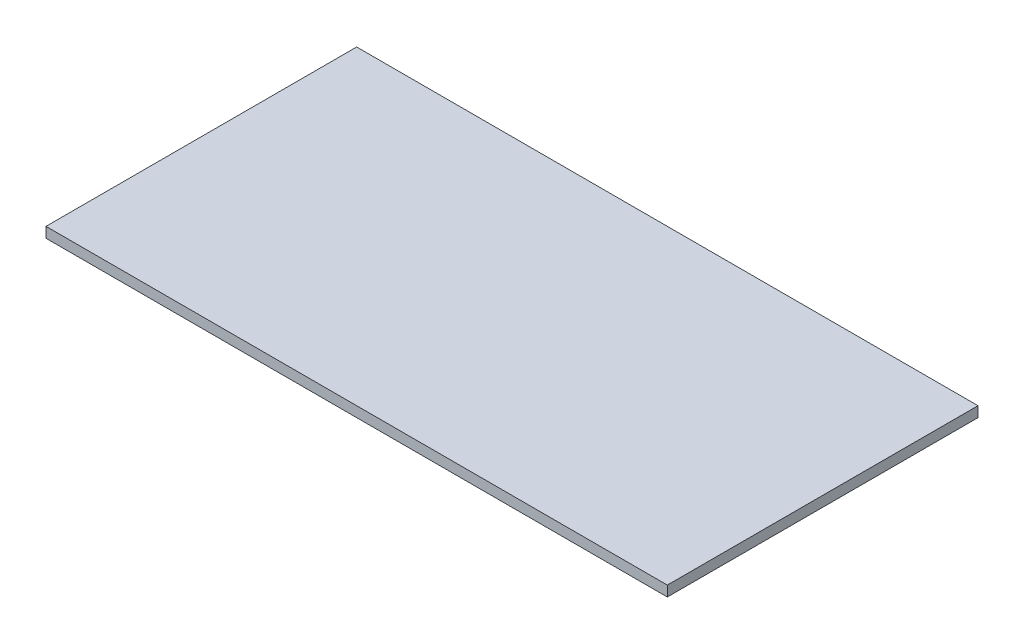
ISO-10303-21;
HEADER;
FILE_DESCRIPTION(('STEP AP214'),'2;1');
FILE_NAME('part.step','',(''),(''),'','','');
FILE_SCHEMA(('AUTOMOTIVE_DESIGN { 1 0 10303 214 1 1 1 1 }'));
ENDSEC;
DATA;
#1=APPLICATION_CONTEXT('core data for automotive mechanical design processes');
#2=APPLICATION_PROTOCOL_DEFINITION('international standard','automotive_design',2000,#1);
#3=PRODUCT_CONTEXT('',#1,'mechanical');
#4=PRODUCT('Part','Part','',(#3));
#5=PRODUCT_RELATED_PRODUCT_CATEGORY('part','',(#4));
#6=PRODUCT_DEFINITION_FORMATION('','',#4);
#7=PRODUCT_DEFINITION_CONTEXT('part definition',#1,'design');
#8=PRODUCT_DEFINITION('design','',#6,#7);
#9=PRODUCT_DEFINITION_SHAPE('','',#8);
#10=(LENGTH_UNIT() NAMED_UNIT(*) SI_UNIT(.MILLI.,.METRE.));
#11=(NAMED_UNIT(*) PLANE_ANGLE_UNIT() SI_UNIT($,.RADIAN.));
#12=(NAMED_UNIT(*) SI_UNIT($,.STERADIAN.) SOLID_ANGLE_UNIT());
#13=UNCERTAINTY_MEASURE_WITH_UNIT(LENGTH_MEASURE(1.E-05),#10,'distance_accuracy_value','');
#14=(GEOMETRIC_REPRESENTATION_CONTEXT(3) GLOBAL_UNCERTAINTY_ASSIGNED_CONTEXT((#13)) GLOBAL_UNIT_ASSIGNED_CONTEXT((#10,
#11,#12)) REPRESENTATION_CONTEXT('',''));
#15=CARTESIAN_POINT('',(0.,0.,0.));
#16=DIRECTION('',(0.,0.,1.));
#17=DIRECTION('',(1.,0.,0.));
#18=AXIS2_PLACEMENT_3D('',#15,#16,#17);
#19=CARTESIAN_POINT('',(-300.,10.,150.));
#20=DIRECTION('',(1.,0.,0.));
#21=DIRECTION('',(0.,0.,-1.));
#22=AXIS2_PLACEMENT_3D('',#19,#20,#21);
#23=PLANE('',#22);
#24=DIRECTION('',(0.,0.,1.));
#25=VECTOR('',#24,1.);
#26=CARTESIAN_POINT('',(-300.,0.,150.));
#27=LINE('',#26,#25);
#28=CARTESIAN_POINT('',(-300.,0.,-150.));
#29=VERTEX_POINT('',#28);
#30=CARTESIAN_POINT('',(-300.,0.,150.));
#31=VERTEX_POINT('',#30);
#32=EDGE_CURVE('E80',#29,#31,#27,.T.);
#33=ORIENTED_EDGE('',*,*,#32,.T.);
#34=DIRECTION('',(0.,-1.,0.));
#35=VECTOR('',#34,1.);
#36=CARTESIAN_POINT('',(-300.,10.,150.));
#37=LINE('',#36,#35);
#38=CARTESIAN_POINT('',(-300.,10.,150.));
#39=VERTEX_POINT('',#38);
#40=EDGE_CURVE('E11',#39,#31,#37,.T.);
#41=ORIENTED_EDGE('',*,*,#40,.F.);
#42=DIRECTION('',(0.,0.,1.));
#43=VECTOR('',#42,1.);
#44=CARTESIAN_POINT('',(-300.,10.,150.));
#45=LINE('',#44,#43);
#46=CARTESIAN_POINT('',(-300.,10.,-150.));
#47=VERTEX_POINT('',#46);
#48=EDGE_CURVE('E68',#47,#39,#45,.T.);
#49=ORIENTED_EDGE('',*,*,#48,.F.);
#50=DIRECTION('',(0.,-1.,0.));
#51=VECTOR('',#50,1.);
#52=CARTESIAN_POINT('',(-300.,10.,-150.));
#53=LINE('',#52,#51);
#54=EDGE_CURVE('E76',#47,#29,#53,.T.);
#55=ORIENTED_EDGE('',*,*,#54,.T.);
#56=EDGE_LOOP('',(#33,#41,#49,#55));
#57=FACE_BOUND('',#56,.T.);
#58=ADVANCED_FACE('F17',(#57),#23,.F.);
#59=CARTESIAN_POINT('',(300.,10.,150.));
#60=DIRECTION('',(0.,0.,-1.));
#61=DIRECTION('',(-1.,0.,0.));
#62=AXIS2_PLACEMENT_3D('',#59,#60,#61);
#63=PLANE('',#62);
#64=DIRECTION('',(1.,0.,0.));
#65=VECTOR('',#64,1.);
#66=CARTESIAN_POINT('',(300.,0.,150.));
#67=LINE('',#66,#65);
#68=CARTESIAN_POINT('',(300.,0.,150.));
#69=VERTEX_POINT('',#68);
#70=EDGE_CURVE('E72',#31,#69,#67,.T.);
#71=ORIENTED_EDGE('',*,*,#70,.T.);
#72=DIRECTION('',(0.,-1.,0.));
#73=VECTOR('',#72,1.);
#74=CARTESIAN_POINT('',(300.,10.,150.));
#75=LINE('',#74,#73);
#76=CARTESIAN_POINT('',(300.,10.,150.));
#77=VERTEX_POINT('',#76);
#78=EDGE_CURVE('E25',#77,#69,#75,.T.);
#79=ORIENTED_EDGE('',*,*,#78,.F.);
#80=DIRECTION('',(1.,0.,0.));
#81=VECTOR('',#80,1.);
#82=CARTESIAN_POINT('',(300.,10.,150.));
#83=LINE('',#82,#81);
#84=EDGE_CURVE('E63',#39,#77,#83,.T.);
#85=ORIENTED_EDGE('',*,*,#84,.F.);
#86=ORIENTED_EDGE('',*,*,#40,.T.);
#87=EDGE_LOOP('',(#71,#79,#85,#86));
#88=FACE_BOUND('',#87,.T.);
#89=ADVANCED_FACE('F71',(#88),#63,.F.);
#90=CARTESIAN_POINT('',(300.,10.,150.));
#91=DIRECTION('',(-1.,0.,0.));
#92=DIRECTION('',(0.,0.,1.));
#93=AXIS2_PLACEMENT_3D('',#90,#91,#92);
#94=PLANE('',#93);
#95=DIRECTION('',(0.,0.,-1.));
#96=VECTOR('',#95,1.);
#97=CARTESIAN_POINT('',(300.,0.,150.));
#98=LINE('',#97,#96);
#99=CARTESIAN_POINT('',(300.,0.,-150.));
#100=VERTEX_POINT('',#99);
#101=EDGE_CURVE('E50',#69,#100,#98,.T.);
#102=ORIENTED_EDGE('',*,*,#101,.T.);
#103=DIRECTION('',(0.,-1.,0.));
#104=VECTOR('',#103,1.);
#105=CARTESIAN_POINT('',(300.,10.,-150.));
#106=LINE('',#105,#104);
#107=CARTESIAN_POINT('',(300.,10.,-150.));
#108=VERTEX_POINT('',#107);
#109=EDGE_CURVE('E73',#108,#100,#106,.T.);
#110=ORIENTED_EDGE('',*,*,#109,.F.);
#111=DIRECTION('',(0.,0.,-1.));
#112=VECTOR('',#111,1.);
#113=CARTESIAN_POINT('',(300.,10.,150.));
#114=LINE('',#113,#112);
#115=EDGE_CURVE('E66',#77,#108,#114,.T.);
#116=ORIENTED_EDGE('',*,*,#115,.F.);
#117=ORIENTED_EDGE('',*,*,#78,.T.);
#118=EDGE_LOOP('',(#102,#110,#116,#117));
#119=FACE_BOUND('',#118,.T.);
#120=ADVANCED_FACE('F74',(#119),#94,.F.);
#121=CARTESIAN_POINT('',(300.,10.,-150.));
#122=DIRECTION('',(0.,0.,1.));
#123=DIRECTION('',(1.,0.,0.));
#124=AXIS2_PLACEMENT_3D('',#121,#122,#123);
#125=PLANE('',#124);
#126=DIRECTION('',(-1.,0.,0.));
#127=VECTOR('',#126,1.);
#128=CARTESIAN_POINT('',(300.,0.,-150.));
#129=LINE('',#128,#127);
#130=EDGE_CURVE('E56',#100,#29,#129,.T.);
#131=ORIENTED_EDGE('',*,*,#130,.T.);
#132=ORIENTED_EDGE('',*,*,#54,.F.);
#133=DIRECTION('',(-1.,0.,0.));
#134=VECTOR('',#133,1.);
#135=CARTESIAN_POINT('',(300.,10.,-150.));
#136=LINE('',#135,#134);
#137=EDGE_CURVE('E33',#108,#47,#136,.T.);
#138=ORIENTED_EDGE('',*,*,#137,.F.);
#139=ORIENTED_EDGE('',*,*,#109,.T.);
#140=EDGE_LOOP('',(#131,#132,#138,#139));
#141=FACE_BOUND('',#140,.T.);
#142=ADVANCED_FACE('F87',(#141),#125,.F.);
#143=CARTESIAN_POINT('',(0.,10.,0.));
#144=DIRECTION('',(0.,1.,0.));
#145=DIRECTION('',(0.,0.,1.));
#146=AXIS2_PLACEMENT_3D('',#143,#144,#145);
#147=PLANE('',#146);
#148=ORIENTED_EDGE('',*,*,#48,.T.);
#149=ORIENTED_EDGE('',*,*,#84,.T.);
#150=ORIENTED_EDGE('',*,*,#115,.T.);
#151=ORIENTED_EDGE('',*,*,#137,.T.);
#152=EDGE_LOOP('',(#148,#149,#150,#151));
#153=FACE_BOUND('',#152,.T.);
#154=ADVANCED_FACE('F64',(#153),#147,.T.);
#155=CARTESIAN_POINT('',(0.,0.,0.));
#156=DIRECTION('',(0.,1.,0.));
#157=DIRECTION('',(0.,0.,1.));
#158=AXIS2_PLACEMENT_3D('',#155,#156,#157);
#159=PLANE('',#158);
#160=ORIENTED_EDGE('',*,*,#32,.F.);
#161=ORIENTED_EDGE('',*,*,#130,.F.);
#162=ORIENTED_EDGE('',*,*,#101,.F.);
#163=ORIENTED_EDGE('',*,*,#70,.F.);
#164=EDGE_LOOP('',(#160,#161,#162,#163));
#165=FACE_BOUND('',#164,.T.);
#166=ADVANCED_FACE('F90',(#165),#159,.F.);
#167=CLOSED_SHELL('',(#58,#89,#120,#142,#154,#166));
#168=MANIFOLD_SOLID_BREP('B1',#167);
#169=ADVANCED_BREP_SHAPE_REPRESENTATION('',(#18,#168),#14);
#170=SHAPE_DEFINITION_REPRESENTATION(#9,#169);
ENDSEC;
END-ISO-10303-21;
